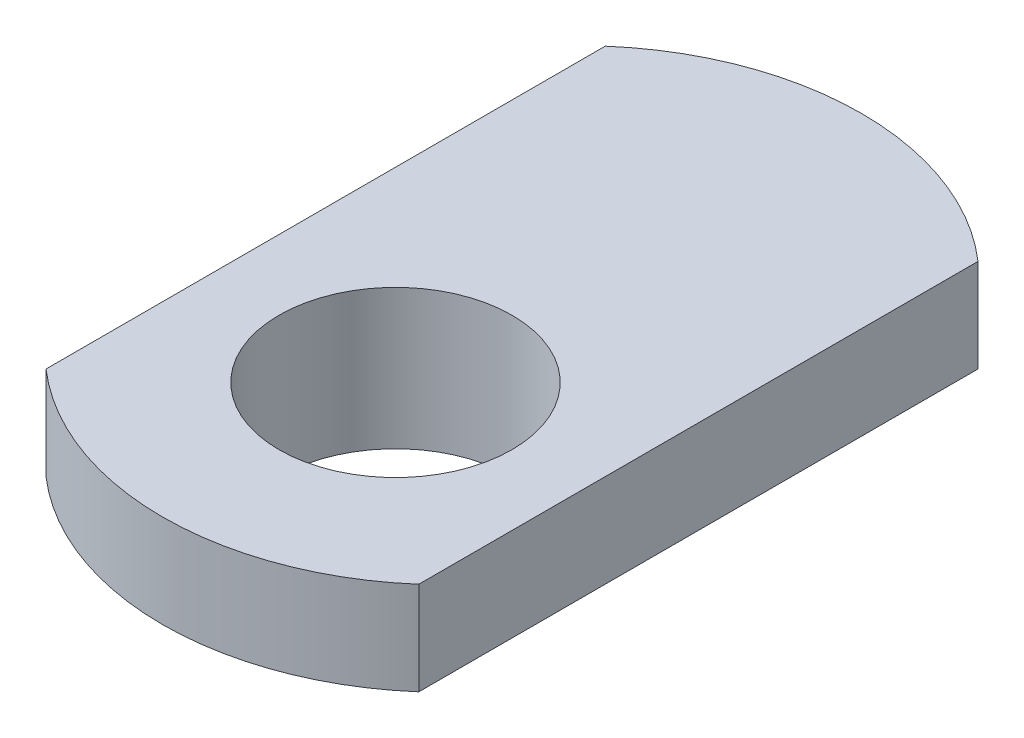
ISO-10303-21;
HEADER;
FILE_DESCRIPTION(('STEP AP214'),'2;1');
FILE_NAME('part.step','',(''),(''),'','','');
FILE_SCHEMA(('AUTOMOTIVE_DESIGN { 1 0 10303 214 1 1 1 1 }'));
ENDSEC;
DATA;
#1=APPLICATION_CONTEXT('core data for automotive mechanical design processes');
#2=APPLICATION_PROTOCOL_DEFINITION('international standard','automotive_design',2000,#1);
#3=PRODUCT_CONTEXT('',#1,'mechanical');
#4=PRODUCT('Part','Part','',(#3));
#5=PRODUCT_RELATED_PRODUCT_CATEGORY('part','',(#4));
#6=PRODUCT_DEFINITION_FORMATION('','',#4);
#7=PRODUCT_DEFINITION_CONTEXT('part definition',#1,'design');
#8=PRODUCT_DEFINITION('design','',#6,#7);
#9=PRODUCT_DEFINITION_SHAPE('','',#8);
#10=(LENGTH_UNIT() NAMED_UNIT(*) SI_UNIT(.MILLI.,.METRE.));
#11=(NAMED_UNIT(*) PLANE_ANGLE_UNIT() SI_UNIT($,.RADIAN.));
#12=(NAMED_UNIT(*) SI_UNIT($,.STERADIAN.) SOLID_ANGLE_UNIT());
#13=UNCERTAINTY_MEASURE_WITH_UNIT(LENGTH_MEASURE(1.E-05),#10,'distance_accuracy_value','');
#14=(GEOMETRIC_REPRESENTATION_CONTEXT(3) GLOBAL_UNCERTAINTY_ASSIGNED_CONTEXT((#13)) GLOBAL_UNIT_ASSIGNED_CONTEXT((#10,
#11,#12)) REPRESENTATION_CONTEXT('',''));
#15=CARTESIAN_POINT('',(0.,0.,0.));
#16=DIRECTION('',(0.,0.,1.));
#17=DIRECTION('',(1.,0.,0.));
#18=AXIS2_PLACEMENT_3D('',#15,#16,#17);
#19=CARTESIAN_POINT('',(-4.,3.975,5.09));
#20=DIRECTION('',(0.,-1.,0.));
#21=DIRECTION('',(0.,0.,-1.));
#22=AXIS2_PLACEMENT_3D('',#19,#20,#21);
#23=PLANE('',#22);
#24=CARTESIAN_POINT('',(0.,3.975,0.));
#25=DIRECTION('',(0.,1.,0.));
#26=DIRECTION('',(0.,0.,1.));
#27=AXIS2_PLACEMENT_3D('',#24,#25,#26);
#28=CIRCLE('',#27,2.5);
#29=CARTESIAN_POINT('',(0.,3.975,2.5));
#30=VERTEX_POINT('',#29);
#31=EDGE_CURVE('E21',#30,#30,#28,.T.);
#32=ORIENTED_EDGE('',*,*,#31,.F.);
#33=EDGE_LOOP('',(#32));
#34=FACE_BOUND('',#33,.T.);
#35=DIRECTION('',(0.,0.,1.));
#36=VECTOR('',#35,1.);
#37=CARTESIAN_POINT('',(-4.,3.975,-2.5));
#38=LINE('',#37,#36);
#39=CARTESIAN_POINT('',(-4.,3.975,-8.50000000060909));
#40=VERTEX_POINT('',#39);
#41=CARTESIAN_POINT('',(-4.,3.975,3.49999999994545));
#42=VERTEX_POINT('',#41);
#43=EDGE_CURVE('E82',#40,#42,#38,.T.);
#44=ORIENTED_EDGE('',*,*,#43,.T.);
#45=CARTESIAN_POINT('',(0.,3.975,-1.083333333));
#46=DIRECTION('',(0.,1.,0.));
#47=DIRECTION('',(0.,0.,1.));
#48=AXIS2_PLACEMENT_3D('',#45,#46,#47);
#49=CIRCLE('',#48,6.083333333);
#50=CARTESIAN_POINT('',(4.00000000094195,3.975,3.49999999906884));
#51=VERTEX_POINT('',#50);
#52=EDGE_CURVE('E60',#42,#51,#49,.T.);
#53=ORIENTED_EDGE('',*,*,#52,.T.);
#54=DIRECTION('',(0.,0.,-1.));
#55=VECTOR('',#54,1.);
#56=CARTESIAN_POINT('',(4.,3.975,-2.5));
#57=LINE('',#56,#55);
#58=CARTESIAN_POINT('',(4.,3.975,-8.50000000060909));
#59=VERTEX_POINT('',#58);
#60=EDGE_CURVE('E56',#51,#59,#57,.T.);
#61=ORIENTED_EDGE('',*,*,#60,.T.);
#62=CARTESIAN_POINT('',(0.,3.975,-3.916666667));
#63=DIRECTION('',(0.,1.,0.));
#64=DIRECTION('',(0.,0.,1.));
#65=AXIS2_PLACEMENT_3D('',#62,#63,#64);
#66=CIRCLE('',#65,6.083333334);
#67=EDGE_CURVE('E58',#59,#40,#66,.T.);
#68=ORIENTED_EDGE('',*,*,#67,.T.);
#69=EDGE_LOOP('',(#44,#53,#61,#68));
#70=FACE_BOUND('',#69,.T.);
#71=ADVANCED_FACE('F17',(#34,#70),#23,.F.);
#72=CARTESIAN_POINT('',(0.,0.975,0.));
#73=DIRECTION('',(0.,1.,0.));
#74=DIRECTION('',(0.,0.,1.));
#75=AXIS2_PLACEMENT_3D('',#72,#73,#74);
#76=CYLINDRICAL_SURFACE('',#75,2.5);
#77=CARTESIAN_POINT('',(0.,0.975,0.));
#78=DIRECTION('',(0.,1.,0.));
#79=DIRECTION('',(0.,0.,1.));
#80=AXIS2_PLACEMENT_3D('',#77,#78,#79);
#81=CIRCLE('',#80,2.5);
#82=CARTESIAN_POINT('',(0.,0.975,2.5));
#83=VERTEX_POINT('',#82);
#84=EDGE_CURVE('E92',#83,#83,#81,.T.);
#85=ORIENTED_EDGE('',*,*,#84,.F.);
#86=EDGE_LOOP('',(#85));
#87=FACE_BOUND('',#86,.T.);
#88=ORIENTED_EDGE('',*,*,#31,.T.);
#89=EDGE_LOOP('',(#88));
#90=FACE_BOUND('',#89,.T.);
#91=ADVANCED_FACE('F133',(#87,#90),#76,.F.);
#92=CARTESIAN_POINT('',(0.,1.975,-3.916666667));
#93=DIRECTION('',(0.,1.,0.));
#94=DIRECTION('',(0.,0.,1.));
#95=AXIS2_PLACEMENT_3D('',#92,#93,#94);
#96=CYLINDRICAL_SURFACE('',#95,6.083333334);
#97=DIRECTION('',(0.,1.,0.));
#98=VECTOR('',#97,1.);
#99=CARTESIAN_POINT('',(-4.,2.975,-8.5));
#100=LINE('',#99,#98);
#101=CARTESIAN_POINT('',(-4.,1.975,-8.50000000060909));
#102=VERTEX_POINT('',#101);
#103=EDGE_CURVE('E71',#102,#40,#100,.T.);
#104=ORIENTED_EDGE('',*,*,#103,.T.);
#105=ORIENTED_EDGE('',*,*,#67,.F.);
#106=DIRECTION('',(0.,-1.,0.));
#107=VECTOR('',#106,1.);
#108=CARTESIAN_POINT('',(4.,2.975,-8.5));
#109=LINE('',#108,#107);
#110=CARTESIAN_POINT('',(4.,1.975,-8.50000000060909));
#111=VERTEX_POINT('',#110);
#112=EDGE_CURVE('E65',#59,#111,#109,.T.);
#113=ORIENTED_EDGE('',*,*,#112,.T.);
#114=CARTESIAN_POINT('',(0.,1.975,-3.916666667));
#115=DIRECTION('',(0.,1.,0.));
#116=DIRECTION('',(0.,0.,1.));
#117=AXIS2_PLACEMENT_3D('',#114,#115,#116);
#118=CIRCLE('',#117,6.083333334);
#119=EDGE_CURVE('E90',#102,#111,#118,.F.);
#120=ORIENTED_EDGE('',*,*,#119,.F.);
#121=EDGE_LOOP('',(#104,#105,#113,#120));
#122=FACE_BOUND('',#121,.T.);
#123=ADVANCED_FACE('F68',(#122),#96,.T.);
#124=CARTESIAN_POINT('',(4.,1.975,-8.5));
#125=DIRECTION('',(-1.,0.,0.));
#126=DIRECTION('',(0.,0.,1.));
#127=AXIS2_PLACEMENT_3D('',#124,#125,#126);
#128=PLANE('',#127);
#129=ORIENTED_EDGE('',*,*,#112,.F.);
#130=ORIENTED_EDGE('',*,*,#60,.F.);
#131=DIRECTION('',(0.,1.,0.));
#132=VECTOR('',#131,1.);
#133=CARTESIAN_POINT('',(4.00000000188391,2.975,3.49999999824677));
#134=LINE('',#133,#132);
#135=CARTESIAN_POINT('',(4.00000000094195,1.975,3.49999999906884));
#136=VERTEX_POINT('',#135);
#137=EDGE_CURVE('E77',#51,#136,#134,.F.);
#138=ORIENTED_EDGE('',*,*,#137,.T.);
#139=DIRECTION('',(0.,0.,1.));
#140=VECTOR('',#139,1.);
#141=CARTESIAN_POINT('',(4.,1.975,-2.5));
#142=LINE('',#141,#140);
#143=EDGE_CURVE('E75',#111,#136,#142,.T.);
#144=ORIENTED_EDGE('',*,*,#143,.F.);
#145=EDGE_LOOP('',(#129,#130,#138,#144));
#146=FACE_BOUND('',#145,.T.);
#147=ADVANCED_FACE('F73',(#146),#128,.F.);
#148=CARTESIAN_POINT('',(0.,1.975,-1.083333333));
#149=DIRECTION('',(0.,1.,0.));
#150=DIRECTION('',(0.,0.,1.));
#151=AXIS2_PLACEMENT_3D('',#148,#149,#150);
#152=CYLINDRICAL_SURFACE('',#151,6.083333333);
#153=CARTESIAN_POINT('',(0.,1.975,-1.083333333));
#154=DIRECTION('',(0.,1.,0.));
#155=DIRECTION('',(0.,0.,1.));
#156=AXIS2_PLACEMENT_3D('',#153,#154,#155);
#157=CIRCLE('',#156,6.083333333);
#158=CARTESIAN_POINT('',(-4.,1.975,3.49999999994545));
#159=VERTEX_POINT('',#158);
#160=EDGE_CURVE('E87',#136,#159,#157,.F.);
#161=ORIENTED_EDGE('',*,*,#160,.F.);
#162=ORIENTED_EDGE('',*,*,#137,.F.);
#163=ORIENTED_EDGE('',*,*,#52,.F.);
#164=DIRECTION('',(0.,-1.,0.));
#165=VECTOR('',#164,1.);
#166=CARTESIAN_POINT('',(-4.,2.975,3.5));
#167=LINE('',#166,#165);
#168=EDGE_CURVE('E36',#42,#159,#167,.T.);
#169=ORIENTED_EDGE('',*,*,#168,.T.);
#170=EDGE_LOOP('',(#161,#162,#163,#169));
#171=FACE_BOUND('',#170,.T.);
#172=ADVANCED_FACE('F102',(#171),#152,.T.);
#173=CARTESIAN_POINT('',(-4.,1.975,3.5));
#174=DIRECTION('',(1.,0.,0.));
#175=DIRECTION('',(0.,0.,-1.));
#176=AXIS2_PLACEMENT_3D('',#173,#174,#175);
#177=PLANE('',#176);
#178=ORIENTED_EDGE('',*,*,#168,.F.);
#179=ORIENTED_EDGE('',*,*,#43,.F.);
#180=ORIENTED_EDGE('',*,*,#103,.F.);
#181=DIRECTION('',(0.,0.,-1.));
#182=VECTOR('',#181,1.);
#183=CARTESIAN_POINT('',(-4.,1.975,-2.5));
#184=LINE('',#183,#182);
#185=EDGE_CURVE('E86',#159,#102,#184,.T.);
#186=ORIENTED_EDGE('',*,*,#185,.F.);
#187=EDGE_LOOP('',(#178,#179,#180,#186));
#188=FACE_BOUND('',#187,.T.);
#189=ADVANCED_FACE('F101',(#188),#177,.F.);
#190=CARTESIAN_POINT('',(-3.036,0.975,3.036));
#191=DIRECTION('',(0.,-1.,0.));
#192=DIRECTION('',(0.,0.,-1.));
#193=AXIS2_PLACEMENT_3D('',#190,#191,#192);
#194=PLANE('',#193);
#195=ORIENTED_EDGE('',*,*,#84,.T.);
#196=EDGE_LOOP('',(#195));
#197=FACE_BOUND('',#196,.T.);
#198=CARTESIAN_POINT('',(0.,0.975,0.));
#199=DIRECTION('',(0.,-1.,0.));
#200=DIRECTION('',(0.,0.,-1.));
#201=AXIS2_PLACEMENT_3D('',#198,#199,#200);
#202=CIRCLE('',#201,3.);
#203=CARTESIAN_POINT('',(0.,0.975,-3.));
#204=VERTEX_POINT('',#203);
#205=EDGE_CURVE('E27',#204,#204,#202,.T.);
#206=ORIENTED_EDGE('',*,*,#205,.T.);
#207=EDGE_LOOP('',(#206));
#208=FACE_BOUND('',#207,.T.);
#209=ADVANCED_FACE('F110',(#197,#208),#194,.T.);
#210=CARTESIAN_POINT('',(-4.,1.975,5.09));
#211=DIRECTION('',(0.,-1.,0.));
#212=DIRECTION('',(0.,0.,-1.));
#213=AXIS2_PLACEMENT_3D('',#210,#211,#212);
#214=PLANE('',#213);
#215=CARTESIAN_POINT('',(0.,1.975,0.));
#216=DIRECTION('',(0.,-1.,0.));
#217=DIRECTION('',(0.,0.,-1.));
#218=AXIS2_PLACEMENT_3D('',#215,#216,#217);
#219=CIRCLE('',#218,3.);
#220=CARTESIAN_POINT('',(0.,1.975,-3.));
#221=VERTEX_POINT('',#220);
#222=EDGE_CURVE('E11',#221,#221,#219,.F.);
#223=ORIENTED_EDGE('',*,*,#222,.T.);
#224=EDGE_LOOP('',(#223));
#225=FACE_BOUND('',#224,.T.);
#226=ORIENTED_EDGE('',*,*,#160,.T.);
#227=ORIENTED_EDGE('',*,*,#185,.T.);
#228=ORIENTED_EDGE('',*,*,#119,.T.);
#229=ORIENTED_EDGE('',*,*,#143,.T.);
#230=EDGE_LOOP('',(#226,#227,#228,#229));
#231=FACE_BOUND('',#230,.T.);
#232=ADVANCED_FACE('F19',(#225,#231),#214,.T.);
#233=CARTESIAN_POINT('',(0.,1.975,0.));
#234=DIRECTION('',(0.,-1.,0.));
#235=DIRECTION('',(0.,0.,-1.));
#236=AXIS2_PLACEMENT_3D('',#233,#234,#235);
#237=CYLINDRICAL_SURFACE('',#236,3.);
#238=ORIENTED_EDGE('',*,*,#222,.F.);
#239=EDGE_LOOP('',(#238));
#240=FACE_BOUND('',#239,.T.);
#241=ORIENTED_EDGE('',*,*,#205,.F.);
#242=EDGE_LOOP('',(#241));
#243=FACE_BOUND('',#242,.T.);
#244=ADVANCED_FACE('F115',(#240,#243),#237,.T.);
#245=CLOSED_SHELL('',(#71,#91,#123,#147,#172,#189,#209,#232,#244));
#246=MANIFOLD_SOLID_BREP('B1',#245);
#247=ADVANCED_BREP_SHAPE_REPRESENTATION('',(#18,#246),#14);
#248=SHAPE_DEFINITION_REPRESENTATION(#9,#247);
ENDSEC;
END-ISO-10303-21;
